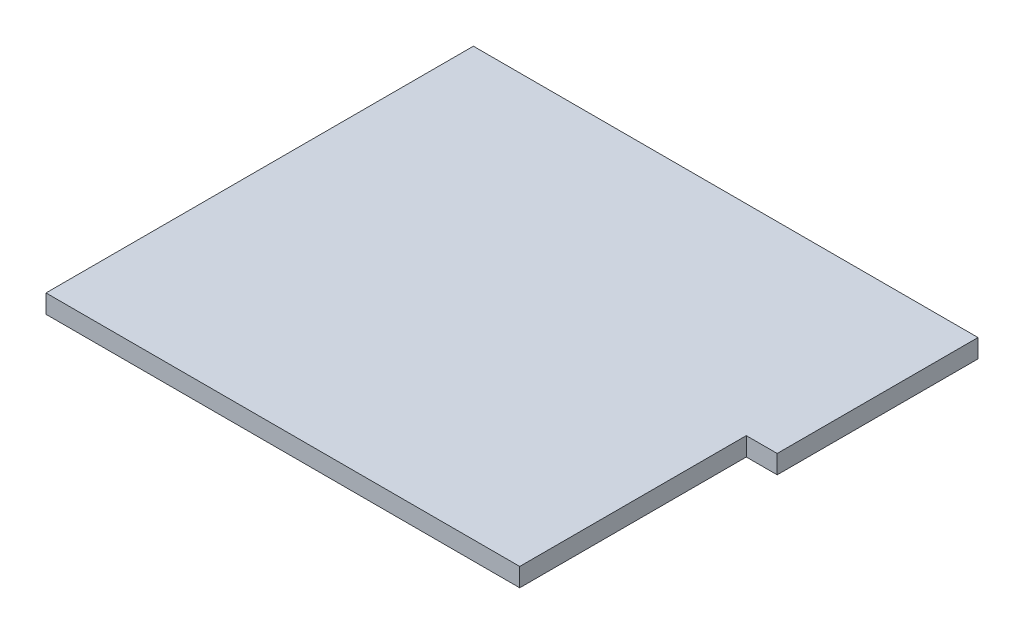
ISO-10303-21;
HEADER;
FILE_DESCRIPTION(('STEP AP214'),'2;1');
FILE_NAME('part.step','',(''),(''),'','','');
FILE_SCHEMA(('AUTOMOTIVE_DESIGN { 1 0 10303 214 1 1 1 1 }'));
ENDSEC;
DATA;
#1=APPLICATION_CONTEXT('core data for automotive mechanical design processes');
#2=APPLICATION_PROTOCOL_DEFINITION('international standard','automotive_design',2000,#1);
#3=PRODUCT_CONTEXT('',#1,'mechanical');
#4=PRODUCT('Part','Part','',(#3));
#5=PRODUCT_RELATED_PRODUCT_CATEGORY('part','',(#4));
#6=PRODUCT_DEFINITION_FORMATION('','',#4);
#7=PRODUCT_DEFINITION_CONTEXT('part definition',#1,'design');
#8=PRODUCT_DEFINITION('design','',#6,#7);
#9=PRODUCT_DEFINITION_SHAPE('','',#8);
#10=(LENGTH_UNIT() NAMED_UNIT(*) SI_UNIT(.MILLI.,.METRE.));
#11=(NAMED_UNIT(*) PLANE_ANGLE_UNIT() SI_UNIT($,.RADIAN.));
#12=(NAMED_UNIT(*) SI_UNIT($,.STERADIAN.) SOLID_ANGLE_UNIT());
#13=UNCERTAINTY_MEASURE_WITH_UNIT(LENGTH_MEASURE(1.E-05),#10,'distance_accuracy_value','');
#14=(GEOMETRIC_REPRESENTATION_CONTEXT(3) GLOBAL_UNCERTAINTY_ASSIGNED_CONTEXT((#13)) GLOBAL_UNIT_ASSIGNED_CONTEXT((#10,
#11,#12)) REPRESENTATION_CONTEXT('',''));
#15=CARTESIAN_POINT('',(0.,0.,0.));
#16=DIRECTION('',(0.,0.,1.));
#17=DIRECTION('',(1.,0.,0.));
#18=AXIS2_PLACEMENT_3D('',#15,#16,#17);
#19=CARTESIAN_POINT('',(-3.,-15.,-409.));
#20=DIRECTION('',(-1.,0.,0.));
#21=DIRECTION('',(0.,0.,1.));
#22=AXIS2_PLACEMENT_3D('',#19,#20,#21);
#23=PLANE('',#22);
#24=DIRECTION('',(0.,0.,1.));
#25=VECTOR('',#24,1.);
#26=CARTESIAN_POINT('',(-3.,3.,0.));
#27=LINE('',#26,#25);
#28=CARTESIAN_POINT('',(-3.,3.,-412.));
#29=VERTEX_POINT('',#28);
#30=CARTESIAN_POINT('',(-3.,3.,3.));
#31=VERTEX_POINT('',#30);
#32=EDGE_CURVE('E123',#29,#31,#27,.T.);
#33=ORIENTED_EDGE('',*,*,#32,.F.);
#34=DIRECTION('',(0.,1.,0.));
#35=VECTOR('',#34,1.);
#36=CARTESIAN_POINT('',(-3.,-15.,-412.));
#37=LINE('',#36,#35);
#38=CARTESIAN_POINT('',(-3.,-15.,-412.));
#39=VERTEX_POINT('',#38);
#40=EDGE_CURVE('E11',#39,#29,#37,.T.);
#41=ORIENTED_EDGE('',*,*,#40,.F.);
#42=DIRECTION('',(0.,0.,1.));
#43=VECTOR('',#42,1.);
#44=CARTESIAN_POINT('',(-3.,-15.,0.));
#45=LINE('',#44,#43);
#46=CARTESIAN_POINT('',(-3.,-15.,3.));
#47=VERTEX_POINT('',#46);
#48=EDGE_CURVE('E128',#39,#47,#45,.T.);
#49=ORIENTED_EDGE('',*,*,#48,.T.);
#50=DIRECTION('',(0.,1.,0.));
#51=VECTOR('',#50,1.);
#52=CARTESIAN_POINT('',(-3.,-15.,3.));
#53=LINE('',#52,#51);
#54=EDGE_CURVE('E82',#47,#31,#53,.T.);
#55=ORIENTED_EDGE('',*,*,#54,.T.);
#56=EDGE_LOOP('',(#33,#41,#49,#55));
#57=FACE_BOUND('',#56,.T.);
#58=ADVANCED_FACE('F35',(#57),#23,.T.);
#59=CARTESIAN_POINT('',(484.,-15.,-412.));
#60=DIRECTION('',(0.,0.,-1.));
#61=DIRECTION('',(-1.,0.,0.));
#62=AXIS2_PLACEMENT_3D('',#59,#60,#61);
#63=PLANE('',#62);
#64=DIRECTION('',(-1.,0.,0.));
#65=VECTOR('',#64,1.);
#66=CARTESIAN_POINT('',(0.,3.,-412.));
#67=LINE('',#66,#65);
#68=CARTESIAN_POINT('',(487.,3.,-412.));
#69=VERTEX_POINT('',#68);
#70=EDGE_CURVE('E130',#69,#29,#67,.T.);
#71=ORIENTED_EDGE('',*,*,#70,.F.);
#72=DIRECTION('',(0.,1.,0.));
#73=VECTOR('',#72,1.);
#74=CARTESIAN_POINT('',(487.,-15.,-412.));
#75=LINE('',#74,#73);
#76=CARTESIAN_POINT('',(487.,-15.,-412.));
#77=VERTEX_POINT('',#76);
#78=EDGE_CURVE('E44',#77,#69,#75,.T.);
#79=ORIENTED_EDGE('',*,*,#78,.F.);
#80=DIRECTION('',(-1.,0.,0.));
#81=VECTOR('',#80,1.);
#82=CARTESIAN_POINT('',(0.,-15.,-412.));
#83=LINE('',#82,#81);
#84=EDGE_CURVE('E131',#77,#39,#83,.T.);
#85=ORIENTED_EDGE('',*,*,#84,.T.);
#86=ORIENTED_EDGE('',*,*,#40,.T.);
#87=EDGE_LOOP('',(#71,#79,#85,#86));
#88=FACE_BOUND('',#87,.T.);
#89=ADVANCED_FACE('F263',(#88),#63,.T.);
#90=CARTESIAN_POINT('',(487.,-15.,-220.));
#91=DIRECTION('',(1.,0.,0.));
#92=DIRECTION('',(0.,0.,-1.));
#93=AXIS2_PLACEMENT_3D('',#90,#91,#92);
#94=PLANE('',#93);
#95=DIRECTION('',(0.,0.,-1.));
#96=VECTOR('',#95,1.);
#97=CARTESIAN_POINT('',(487.,3.,0.));
#98=LINE('',#97,#96);
#99=CARTESIAN_POINT('',(487.,3.,-217.));
#100=VERTEX_POINT('',#99);
#101=EDGE_CURVE('E151',#100,#69,#98,.T.);
#102=ORIENTED_EDGE('',*,*,#101,.F.);
#103=DIRECTION('',(0.,1.,0.));
#104=VECTOR('',#103,1.);
#105=CARTESIAN_POINT('',(487.,-15.,-217.));
#106=LINE('',#105,#104);
#107=CARTESIAN_POINT('',(487.,-15.,-217.));
#108=VERTEX_POINT('',#107);
#109=EDGE_CURVE('E146',#108,#100,#106,.T.);
#110=ORIENTED_EDGE('',*,*,#109,.F.);
#111=DIRECTION('',(0.,0.,-1.));
#112=VECTOR('',#111,1.);
#113=CARTESIAN_POINT('',(487.,-15.,0.));
#114=LINE('',#113,#112);
#115=EDGE_CURVE('E133',#108,#77,#114,.T.);
#116=ORIENTED_EDGE('',*,*,#115,.T.);
#117=ORIENTED_EDGE('',*,*,#78,.T.);
#118=EDGE_LOOP('',(#102,#110,#116,#117));
#119=FACE_BOUND('',#118,.T.);
#120=ADVANCED_FACE('F268',(#119),#94,.T.);
#121=CARTESIAN_POINT('',(454.,-15.,-217.));
#122=DIRECTION('',(0.,0.,1.));
#123=DIRECTION('',(1.,0.,0.));
#124=AXIS2_PLACEMENT_3D('',#121,#122,#123);
#125=PLANE('',#124);
#126=DIRECTION('',(1.,0.,0.));
#127=VECTOR('',#126,1.);
#128=CARTESIAN_POINT('',(0.,3.,-217.));
#129=LINE('',#128,#127);
#130=CARTESIAN_POINT('',(457.,3.,-217.));
#131=VERTEX_POINT('',#130);
#132=EDGE_CURVE('E120',#131,#100,#129,.T.);
#133=ORIENTED_EDGE('',*,*,#132,.F.);
#134=DIRECTION('',(0.,1.,0.));
#135=VECTOR('',#134,1.);
#136=CARTESIAN_POINT('',(457.,-15.,-217.));
#137=LINE('',#136,#135);
#138=CARTESIAN_POINT('',(457.,-15.,-217.));
#139=VERTEX_POINT('',#138);
#140=EDGE_CURVE('E105',#139,#131,#137,.T.);
#141=ORIENTED_EDGE('',*,*,#140,.F.);
#142=DIRECTION('',(1.,0.,0.));
#143=VECTOR('',#142,1.);
#144=CARTESIAN_POINT('',(0.,-15.,-217.));
#145=LINE('',#144,#143);
#146=EDGE_CURVE('E136',#139,#108,#145,.T.);
#147=ORIENTED_EDGE('',*,*,#146,.T.);
#148=ORIENTED_EDGE('',*,*,#109,.T.);
#149=EDGE_LOOP('',(#133,#141,#147,#148));
#150=FACE_BOUND('',#149,.T.);
#151=ADVANCED_FACE('F145',(#150),#125,.T.);
#152=CARTESIAN_POINT('',(457.,-15.,0.));
#153=DIRECTION('',(1.,0.,0.));
#154=DIRECTION('',(0.,0.,-1.));
#155=AXIS2_PLACEMENT_3D('',#152,#153,#154);
#156=PLANE('',#155);
#157=DIRECTION('',(0.,0.,-1.));
#158=VECTOR('',#157,1.);
#159=CARTESIAN_POINT('',(457.,3.,0.));
#160=LINE('',#159,#158);
#161=CARTESIAN_POINT('',(457.,3.,3.));
#162=VERTEX_POINT('',#161);
#163=EDGE_CURVE('E116',#162,#131,#160,.T.);
#164=ORIENTED_EDGE('',*,*,#163,.F.);
#165=DIRECTION('',(0.,1.,0.));
#166=VECTOR('',#165,1.);
#167=CARTESIAN_POINT('',(457.,-15.,3.));
#168=LINE('',#167,#166);
#169=CARTESIAN_POINT('',(457.,-15.,3.));
#170=VERTEX_POINT('',#169);
#171=EDGE_CURVE('E108',#170,#162,#168,.T.);
#172=ORIENTED_EDGE('',*,*,#171,.F.);
#173=DIRECTION('',(0.,0.,-1.));
#174=VECTOR('',#173,1.);
#175=CARTESIAN_POINT('',(457.,-15.,0.));
#176=LINE('',#175,#174);
#177=EDGE_CURVE('E138',#170,#139,#176,.T.);
#178=ORIENTED_EDGE('',*,*,#177,.T.);
#179=ORIENTED_EDGE('',*,*,#140,.T.);
#180=EDGE_LOOP('',(#164,#172,#178,#179));
#181=FACE_BOUND('',#180,.T.);
#182=ADVANCED_FACE('F117',(#181),#156,.T.);
#183=CARTESIAN_POINT('',(0.,-15.,3.));
#184=DIRECTION('',(0.,0.,1.));
#185=DIRECTION('',(1.,0.,0.));
#186=AXIS2_PLACEMENT_3D('',#183,#184,#185);
#187=PLANE('',#186);
#188=DIRECTION('',(1.,0.,0.));
#189=VECTOR('',#188,1.);
#190=CARTESIAN_POINT('',(0.,3.,3.));
#191=LINE('',#190,#189);
#192=EDGE_CURVE('E111',#31,#162,#191,.T.);
#193=ORIENTED_EDGE('',*,*,#192,.F.);
#194=ORIENTED_EDGE('',*,*,#54,.F.);
#195=DIRECTION('',(1.,0.,0.));
#196=VECTOR('',#195,1.);
#197=CARTESIAN_POINT('',(0.,-15.,3.));
#198=LINE('',#197,#196);
#199=EDGE_CURVE('E39',#47,#170,#198,.T.);
#200=ORIENTED_EDGE('',*,*,#199,.T.);
#201=ORIENTED_EDGE('',*,*,#171,.T.);
#202=EDGE_LOOP('',(#193,#194,#200,#201));
#203=FACE_BOUND('',#202,.T.);
#204=ADVANCED_FACE('F109',(#203),#187,.T.);
#205=CARTESIAN_POINT('',(0.,-15.,0.));
#206=DIRECTION('',(0.,1.,0.));
#207=DIRECTION('',(0.,0.,1.));
#208=AXIS2_PLACEMENT_3D('',#205,#206,#207);
#209=PLANE('',#208);
#210=DIRECTION('',(-1.,0.,0.));
#211=VECTOR('',#210,1.);
#212=CARTESIAN_POINT('',(484.,-15.,-409.));
#213=LINE('',#212,#211);
#214=CARTESIAN_POINT('',(484.,-15.,-409.));
#215=VERTEX_POINT('',#214);
#216=CARTESIAN_POINT('',(0.,-15.,-409.));
#217=VERTEX_POINT('',#216);
#218=EDGE_CURVE('E162',#215,#217,#213,.T.);
#219=ORIENTED_EDGE('',*,*,#218,.T.);
#220=DIRECTION('',(0.,0.,1.));
#221=VECTOR('',#220,1.);
#222=CARTESIAN_POINT('',(0.,-15.,-409.));
#223=LINE('',#222,#221);
#224=CARTESIAN_POINT('',(0.,-15.,0.));
#225=VERTEX_POINT('',#224);
#226=EDGE_CURVE('E178',#217,#225,#223,.T.);
#227=ORIENTED_EDGE('',*,*,#226,.T.);
#228=DIRECTION('',(1.,0.,0.));
#229=VECTOR('',#228,1.);
#230=CARTESIAN_POINT('',(0.,-15.,0.));
#231=LINE('',#230,#229);
#232=CARTESIAN_POINT('',(454.,-15.,0.));
#233=VERTEX_POINT('',#232);
#234=EDGE_CURVE('E203',#225,#233,#231,.T.);
#235=ORIENTED_EDGE('',*,*,#234,.T.);
#236=DIRECTION('',(0.,0.,-1.));
#237=VECTOR('',#236,1.);
#238=CARTESIAN_POINT('',(454.,-15.,0.));
#239=LINE('',#238,#237);
#240=CARTESIAN_POINT('',(454.,-15.,-220.));
#241=VERTEX_POINT('',#240);
#242=EDGE_CURVE('E52',#233,#241,#239,.T.);
#243=ORIENTED_EDGE('',*,*,#242,.T.);
#244=DIRECTION('',(1.,0.,0.));
#245=VECTOR('',#244,1.);
#246=CARTESIAN_POINT('',(454.,-15.,-220.));
#247=LINE('',#246,#245);
#248=CARTESIAN_POINT('',(484.,-15.,-220.));
#249=VERTEX_POINT('',#248);
#250=EDGE_CURVE('E199',#241,#249,#247,.T.);
#251=ORIENTED_EDGE('',*,*,#250,.T.);
#252=DIRECTION('',(0.,0.,-1.));
#253=VECTOR('',#252,1.);
#254=CARTESIAN_POINT('',(484.,-15.,-220.));
#255=LINE('',#254,#253);
#256=EDGE_CURVE('E196',#249,#215,#255,.T.);
#257=ORIENTED_EDGE('',*,*,#256,.T.);
#258=EDGE_LOOP('',(#219,#227,#235,#243,#251,#257));
#259=FACE_BOUND('',#258,.T.);
#260=ORIENTED_EDGE('',*,*,#48,.F.);
#261=ORIENTED_EDGE('',*,*,#84,.F.);
#262=ORIENTED_EDGE('',*,*,#115,.F.);
#263=ORIENTED_EDGE('',*,*,#146,.F.);
#264=ORIENTED_EDGE('',*,*,#177,.F.);
#265=ORIENTED_EDGE('',*,*,#199,.F.);
#266=EDGE_LOOP('',(#260,#261,#262,#263,#264,#265));
#267=FACE_BOUND('',#266,.T.);
#268=ADVANCED_FACE('F141',(#259,#267),#209,.F.);
#269=CARTESIAN_POINT('',(0.,3.,0.));
#270=DIRECTION('',(0.,1.,0.));
#271=DIRECTION('',(0.,0.,1.));
#272=AXIS2_PLACEMENT_3D('',#269,#270,#271);
#273=PLANE('',#272);
#274=ORIENTED_EDGE('',*,*,#32,.T.);
#275=ORIENTED_EDGE('',*,*,#192,.T.);
#276=ORIENTED_EDGE('',*,*,#163,.T.);
#277=ORIENTED_EDGE('',*,*,#132,.T.);
#278=ORIENTED_EDGE('',*,*,#101,.T.);
#279=ORIENTED_EDGE('',*,*,#70,.T.);
#280=EDGE_LOOP('',(#274,#275,#276,#277,#278,#279));
#281=FACE_BOUND('',#280,.T.);
#282=ADVANCED_FACE('F37',(#281),#273,.T.);
#283=CARTESIAN_POINT('',(0.,-15.,-409.));
#284=DIRECTION('',(-1.,0.,0.));
#285=DIRECTION('',(0.,0.,1.));
#286=AXIS2_PLACEMENT_3D('',#283,#284,#285);
#287=PLANE('',#286);
#288=DIRECTION('',(0.,0.,1.));
#289=VECTOR('',#288,1.);
#290=CARTESIAN_POINT('',(0.,0.,-409.));
#291=LINE('',#290,#289);
#292=CARTESIAN_POINT('',(0.,0.,-409.));
#293=VERTEX_POINT('',#292);
#294=CARTESIAN_POINT('',(0.,0.,0.));
#295=VERTEX_POINT('',#294);
#296=EDGE_CURVE('E191',#293,#295,#291,.T.);
#297=ORIENTED_EDGE('',*,*,#296,.T.);
#298=DIRECTION('',(0.,1.,0.));
#299=VECTOR('',#298,1.);
#300=CARTESIAN_POINT('',(0.,-15.,0.));
#301=LINE('',#300,#299);
#302=EDGE_CURVE('E158',#225,#295,#301,.T.);
#303=ORIENTED_EDGE('',*,*,#302,.F.);
#304=ORIENTED_EDGE('',*,*,#226,.F.);
#305=DIRECTION('',(0.,1.,0.));
#306=VECTOR('',#305,1.);
#307=CARTESIAN_POINT('',(0.,-15.,-409.));
#308=LINE('',#307,#306);
#309=EDGE_CURVE('E125',#217,#293,#308,.T.);
#310=ORIENTED_EDGE('',*,*,#309,.T.);
#311=EDGE_LOOP('',(#297,#303,#304,#310));
#312=FACE_BOUND('',#311,.T.);
#313=ADVANCED_FACE('F216',(#312),#287,.F.);
#314=CARTESIAN_POINT('',(484.,-15.,-409.));
#315=DIRECTION('',(0.,0.,-1.));
#316=DIRECTION('',(-1.,0.,0.));
#317=AXIS2_PLACEMENT_3D('',#314,#315,#316);
#318=PLANE('',#317);
#319=DIRECTION('',(-1.,0.,0.));
#320=VECTOR('',#319,1.);
#321=CARTESIAN_POINT('',(484.,0.,-409.));
#322=LINE('',#321,#320);
#323=CARTESIAN_POINT('',(484.,0.,-409.));
#324=VERTEX_POINT('',#323);
#325=EDGE_CURVE('E175',#324,#293,#322,.T.);
#326=ORIENTED_EDGE('',*,*,#325,.T.);
#327=ORIENTED_EDGE('',*,*,#309,.F.);
#328=ORIENTED_EDGE('',*,*,#218,.F.);
#329=DIRECTION('',(0.,1.,0.));
#330=VECTOR('',#329,1.);
#331=CARTESIAN_POINT('',(484.,-15.,-409.));
#332=LINE('',#331,#330);
#333=EDGE_CURVE('E170',#215,#324,#332,.T.);
#334=ORIENTED_EDGE('',*,*,#333,.T.);
#335=EDGE_LOOP('',(#326,#327,#328,#334));
#336=FACE_BOUND('',#335,.T.);
#337=ADVANCED_FACE('F235',(#336),#318,.F.);
#338=CARTESIAN_POINT('',(484.,-15.,-220.));
#339=DIRECTION('',(1.,0.,0.));
#340=DIRECTION('',(0.,0.,-1.));
#341=AXIS2_PLACEMENT_3D('',#338,#339,#340);
#342=PLANE('',#341);
#343=DIRECTION('',(0.,0.,-1.));
#344=VECTOR('',#343,1.);
#345=CARTESIAN_POINT('',(484.,0.,-220.));
#346=LINE('',#345,#344);
#347=CARTESIAN_POINT('',(484.,0.,-220.));
#348=VERTEX_POINT('',#347);
#349=EDGE_CURVE('E179',#348,#324,#346,.T.);
#350=ORIENTED_EDGE('',*,*,#349,.T.);
#351=ORIENTED_EDGE('',*,*,#333,.F.);
#352=ORIENTED_EDGE('',*,*,#256,.F.);
#353=DIRECTION('',(0.,1.,0.));
#354=VECTOR('',#353,1.);
#355=CARTESIAN_POINT('',(484.,-15.,-220.));
#356=LINE('',#355,#354);
#357=EDGE_CURVE('E167',#249,#348,#356,.T.);
#358=ORIENTED_EDGE('',*,*,#357,.T.);
#359=EDGE_LOOP('',(#350,#351,#352,#358));
#360=FACE_BOUND('',#359,.T.);
#361=ADVANCED_FACE('F240',(#360),#342,.F.);
#362=CARTESIAN_POINT('',(454.,-15.,-220.));
#363=DIRECTION('',(0.,0.,1.));
#364=DIRECTION('',(1.,0.,0.));
#365=AXIS2_PLACEMENT_3D('',#362,#363,#364);
#366=PLANE('',#365);
#367=DIRECTION('',(1.,0.,0.));
#368=VECTOR('',#367,1.);
#369=CARTESIAN_POINT('',(454.,0.,-220.));
#370=LINE('',#369,#368);
#371=CARTESIAN_POINT('',(454.,0.,-220.));
#372=VERTEX_POINT('',#371);
#373=EDGE_CURVE('E182',#372,#348,#370,.T.);
#374=ORIENTED_EDGE('',*,*,#373,.T.);
#375=ORIENTED_EDGE('',*,*,#357,.F.);
#376=ORIENTED_EDGE('',*,*,#250,.F.);
#377=DIRECTION('',(0.,1.,0.));
#378=VECTOR('',#377,1.);
#379=CARTESIAN_POINT('',(454.,-15.,-220.));
#380=LINE('',#379,#378);
#381=EDGE_CURVE('E164',#241,#372,#380,.T.);
#382=ORIENTED_EDGE('',*,*,#381,.T.);
#383=EDGE_LOOP('',(#374,#375,#376,#382));
#384=FACE_BOUND('',#383,.T.);
#385=ADVANCED_FACE('F253',(#384),#366,.F.);
#386=CARTESIAN_POINT('',(454.,-15.,0.));
#387=DIRECTION('',(1.,0.,0.));
#388=DIRECTION('',(0.,0.,-1.));
#389=AXIS2_PLACEMENT_3D('',#386,#387,#388);
#390=PLANE('',#389);
#391=DIRECTION('',(0.,0.,-1.));
#392=VECTOR('',#391,1.);
#393=CARTESIAN_POINT('',(454.,0.,0.));
#394=LINE('',#393,#392);
#395=CARTESIAN_POINT('',(454.,0.,0.));
#396=VERTEX_POINT('',#395);
#397=EDGE_CURVE('E185',#396,#372,#394,.T.);
#398=ORIENTED_EDGE('',*,*,#397,.T.);
#399=ORIENTED_EDGE('',*,*,#381,.F.);
#400=ORIENTED_EDGE('',*,*,#242,.F.);
#401=DIRECTION('',(0.,1.,0.));
#402=VECTOR('',#401,1.);
#403=CARTESIAN_POINT('',(454.,-15.,0.));
#404=LINE('',#403,#402);
#405=EDGE_CURVE('E161',#233,#396,#404,.T.);
#406=ORIENTED_EDGE('',*,*,#405,.T.);
#407=EDGE_LOOP('',(#398,#399,#400,#406));
#408=FACE_BOUND('',#407,.T.);
#409=ADVANCED_FACE('F249',(#408),#390,.F.);
#410=CARTESIAN_POINT('',(0.,-15.,0.));
#411=DIRECTION('',(0.,0.,1.));
#412=DIRECTION('',(1.,0.,0.));
#413=AXIS2_PLACEMENT_3D('',#410,#411,#412);
#414=PLANE('',#413);
#415=DIRECTION('',(1.,0.,0.));
#416=VECTOR('',#415,1.);
#417=CARTESIAN_POINT('',(0.,0.,0.));
#418=LINE('',#417,#416);
#419=EDGE_CURVE('E188',#295,#396,#418,.T.);
#420=ORIENTED_EDGE('',*,*,#419,.T.);
#421=ORIENTED_EDGE('',*,*,#405,.F.);
#422=ORIENTED_EDGE('',*,*,#234,.F.);
#423=ORIENTED_EDGE('',*,*,#302,.T.);
#424=EDGE_LOOP('',(#420,#421,#422,#423));
#425=FACE_BOUND('',#424,.T.);
#426=ADVANCED_FACE('F248',(#425),#414,.F.);
#427=CARTESIAN_POINT('',(0.,0.,0.));
#428=DIRECTION('',(0.,1.,0.));
#429=DIRECTION('',(0.,0.,1.));
#430=AXIS2_PLACEMENT_3D('',#427,#428,#429);
#431=PLANE('',#430);
#432=ORIENTED_EDGE('',*,*,#296,.F.);
#433=ORIENTED_EDGE('',*,*,#325,.F.);
#434=ORIENTED_EDGE('',*,*,#349,.F.);
#435=ORIENTED_EDGE('',*,*,#373,.F.);
#436=ORIENTED_EDGE('',*,*,#397,.F.);
#437=ORIENTED_EDGE('',*,*,#419,.F.);
#438=EDGE_LOOP('',(#432,#433,#434,#435,#436,#437));
#439=FACE_BOUND('',#438,.T.);
#440=ADVANCED_FACE('F244',(#439),#431,.F.);
#441=CLOSED_SHELL('',(#58,#89,#120,#151,#182,#204,#268,#282,#313,#337,#361,#385,#409,#426,#440));
#442=MANIFOLD_SOLID_BREP('B2',#441);
#443=ADVANCED_BREP_SHAPE_REPRESENTATION('',(#18,#442),#14);
#444=SHAPE_DEFINITION_REPRESENTATION(#9,#443);
ENDSEC;
END-ISO-10303-21;
